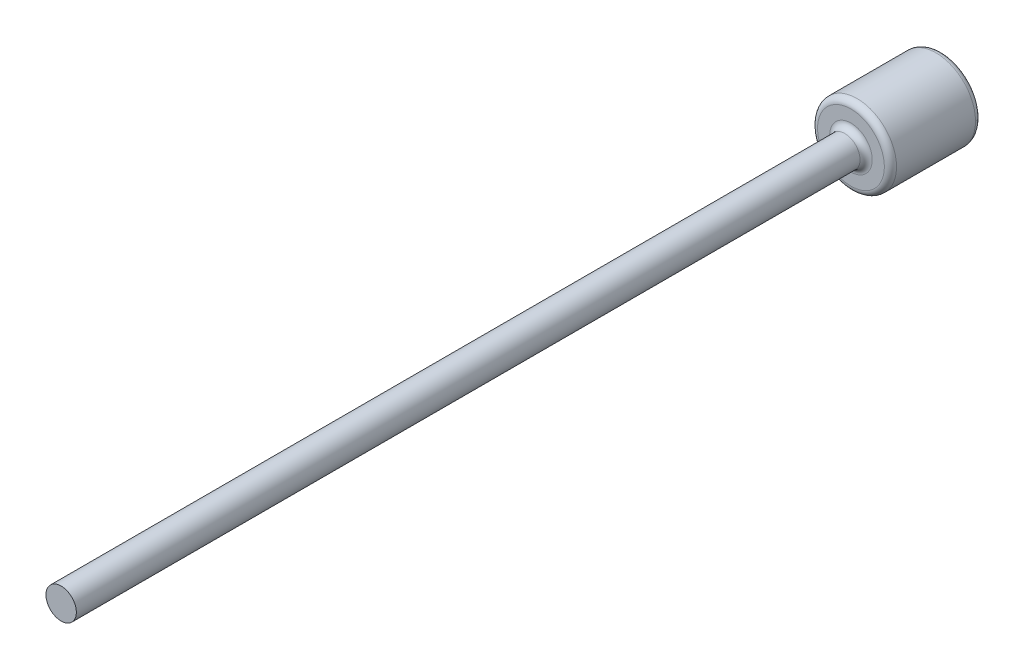
ISO-10303-21;
HEADER;
FILE_DESCRIPTION(('STEP AP214'),'2;1');
FILE_NAME('part.step','',(''),(''),'','','');
FILE_SCHEMA(('AUTOMOTIVE_DESIGN { 1 0 10303 214 1 1 1 1 }'));
ENDSEC;
DATA;
#1=APPLICATION_CONTEXT('core data for automotive mechanical design processes');
#2=APPLICATION_PROTOCOL_DEFINITION('international standard','automotive_design',2000,#1);
#3=PRODUCT_CONTEXT('',#1,'mechanical');
#4=PRODUCT('Part','Part','',(#3));
#5=PRODUCT_RELATED_PRODUCT_CATEGORY('part','',(#4));
#6=PRODUCT_DEFINITION_FORMATION('','',#4);
#7=PRODUCT_DEFINITION_CONTEXT('part definition',#1,'design');
#8=PRODUCT_DEFINITION('design','',#6,#7);
#9=PRODUCT_DEFINITION_SHAPE('','',#8);
#10=(LENGTH_UNIT() NAMED_UNIT(*) SI_UNIT(.MILLI.,.METRE.));
#11=(NAMED_UNIT(*) PLANE_ANGLE_UNIT() SI_UNIT($,.RADIAN.));
#12=(NAMED_UNIT(*) SI_UNIT($,.STERADIAN.) SOLID_ANGLE_UNIT());
#13=UNCERTAINTY_MEASURE_WITH_UNIT(LENGTH_MEASURE(1.E-05),#10,'distance_accuracy_value','');
#14=(GEOMETRIC_REPRESENTATION_CONTEXT(3) GLOBAL_UNCERTAINTY_ASSIGNED_CONTEXT((#13)) GLOBAL_UNIT_ASSIGNED_CONTEXT((#10,
#11,#12)) REPRESENTATION_CONTEXT('',''));
#15=CARTESIAN_POINT('',(0.,0.,0.));
#16=DIRECTION('',(0.,0.,1.));
#17=DIRECTION('',(1.,0.,0.));
#18=AXIS2_PLACEMENT_3D('',#15,#16,#17);
#19=CARTESIAN_POINT('',(0.,0.,-30.));
#20=DIRECTION('',(0.,0.,1.));
#21=DIRECTION('',(1.,0.,0.));
#22=AXIS2_PLACEMENT_3D('',#19,#20,#21);
#23=CYLINDRICAL_SURFACE('',#22,13.);
#24=CARTESIAN_POINT('',(0.,0.,-28.));
#25=DIRECTION('',(0.,0.,1.));
#26=DIRECTION('',(1.,0.,0.));
#27=AXIS2_PLACEMENT_3D('',#24,#25,#26);
#28=CIRCLE('',#27,13.);
#29=CARTESIAN_POINT('',(13.,0.,-28.));
#30=VERTEX_POINT('',#29);
#31=EDGE_CURVE('E52',#30,#30,#28,.T.);
#32=ORIENTED_EDGE('',*,*,#31,.T.);
#33=EDGE_LOOP('',(#32));
#34=FACE_BOUND('',#33,.T.);
#35=CARTESIAN_POINT('',(0.,0.,-2.));
#36=DIRECTION('',(0.,0.,1.));
#37=DIRECTION('',(1.,0.,0.));
#38=AXIS2_PLACEMENT_3D('',#35,#36,#37);
#39=CIRCLE('',#38,13.);
#40=CARTESIAN_POINT('',(13.,0.,-2.));
#41=VERTEX_POINT('',#40);
#42=EDGE_CURVE('E55',#41,#41,#39,.F.);
#43=ORIENTED_EDGE('',*,*,#42,.T.);
#44=EDGE_LOOP('',(#43));
#45=FACE_BOUND('',#44,.T.);
#46=ADVANCED_FACE('F32',(#34,#45),#23,.T.);
#47=CARTESIAN_POINT('',(0.,0.,-30.));
#48=DIRECTION('',(0.,0.,1.));
#49=DIRECTION('',(1.,0.,0.));
#50=AXIS2_PLACEMENT_3D('',#47,#48,#49);
#51=PLANE('',#50);
#52=CARTESIAN_POINT('',(0.,0.,-30.));
#53=DIRECTION('',(0.,0.,1.));
#54=DIRECTION('',(1.,0.,0.));
#55=AXIS2_PLACEMENT_3D('',#52,#53,#54);
#56=CIRCLE('',#55,11.);
#57=CARTESIAN_POINT('',(11.,0.,-30.));
#58=VERTEX_POINT('',#57);
#59=EDGE_CURVE('E47',#58,#58,#56,.F.);
#60=ORIENTED_EDGE('',*,*,#59,.T.);
#61=EDGE_LOOP('',(#60));
#62=FACE_BOUND('',#61,.T.);
#63=ADVANCED_FACE('F74',(#62),#51,.F.);
#64=CARTESIAN_POINT('',(0.,0.,0.));
#65=DIRECTION('',(0.,0.,1.));
#66=DIRECTION('',(1.,0.,0.));
#67=AXIS2_PLACEMENT_3D('',#64,#65,#66);
#68=PLANE('',#67);
#69=CARTESIAN_POINT('',(0.,0.,0.));
#70=DIRECTION('',(0.,0.,1.));
#71=DIRECTION('',(1.,0.,0.));
#72=AXIS2_PLACEMENT_3D('',#69,#70,#71);
#73=CIRCLE('',#72,11.);
#74=CARTESIAN_POINT('',(11.,0.,0.));
#75=VERTEX_POINT('',#74);
#76=EDGE_CURVE('E39',#75,#75,#73,.T.);
#77=ORIENTED_EDGE('',*,*,#76,.T.);
#78=EDGE_LOOP('',(#77));
#79=FACE_BOUND('',#78,.T.);
#80=CARTESIAN_POINT('',(0.,0.,0.));
#81=DIRECTION('',(0.,0.,1.));
#82=DIRECTION('',(1.,0.,0.));
#83=AXIS2_PLACEMENT_3D('',#80,#81,#82);
#84=CIRCLE('',#83,7.);
#85=CARTESIAN_POINT('',(7.,0.,0.));
#86=VERTEX_POINT('',#85);
#87=EDGE_CURVE('E43',#86,#86,#84,.F.);
#88=ORIENTED_EDGE('',*,*,#87,.T.);
#89=EDGE_LOOP('',(#88));
#90=FACE_BOUND('',#89,.T.);
#91=ADVANCED_FACE('F66',(#79,#90),#68,.T.);
#92=CARTESIAN_POINT('',(0.,0.,240.));
#93=DIRECTION('',(0.,0.,-1.));
#94=DIRECTION('',(-1.,0.,0.));
#95=AXIS2_PLACEMENT_3D('',#92,#93,#94);
#96=CYLINDRICAL_SURFACE('',#95,5.);
#97=CARTESIAN_POINT('',(0.,0.,2.));
#98=DIRECTION('',(0.,0.,1.));
#99=DIRECTION('',(1.,0.,0.));
#100=AXIS2_PLACEMENT_3D('',#97,#98,#99);
#101=CIRCLE('',#100,5.);
#102=CARTESIAN_POINT('',(5.,0.,2.));
#103=VERTEX_POINT('',#102);
#104=EDGE_CURVE('E10',#103,#103,#101,.T.);
#105=ORIENTED_EDGE('',*,*,#104,.T.);
#106=EDGE_LOOP('',(#105));
#107=FACE_BOUND('',#106,.T.);
#108=CARTESIAN_POINT('',(0.,0.,260.));
#109=DIRECTION('',(0.,0.,1.));
#110=DIRECTION('',(1.,0.,0.));
#111=AXIS2_PLACEMENT_3D('',#108,#109,#110);
#112=CIRCLE('',#111,5.);
#113=CARTESIAN_POINT('',(5.,0.,260.));
#114=VERTEX_POINT('',#113);
#115=EDGE_CURVE('E58',#114,#114,#112,.T.);
#116=ORIENTED_EDGE('',*,*,#115,.F.);
#117=EDGE_LOOP('',(#116));
#118=FACE_BOUND('',#117,.T.);
#119=ADVANCED_FACE('F64',(#107,#118),#96,.T.);
#120=CARTESIAN_POINT('',(0.,0.,260.));
#121=DIRECTION('',(0.,0.,1.));
#122=DIRECTION('',(1.,0.,0.));
#123=AXIS2_PLACEMENT_3D('',#120,#121,#122);
#124=PLANE('',#123);
#125=ORIENTED_EDGE('',*,*,#115,.T.);
#126=EDGE_LOOP('',(#125));
#127=FACE_BOUND('',#126,.T.);
#128=ADVANCED_FACE('F62',(#127),#124,.T.);
#129=CARTESIAN_POINT('',(0.,0.,-28.));
#130=DIRECTION('',(0.,0.,1.));
#131=DIRECTION('',(1.,0.,0.));
#132=AXIS2_PLACEMENT_3D('',#129,#130,#131);
#133=TOROIDAL_SURFACE('',#132,11.,2.);
#134=ORIENTED_EDGE('',*,*,#59,.F.);
#135=EDGE_LOOP('',(#134));
#136=FACE_BOUND('',#135,.T.);
#137=ORIENTED_EDGE('',*,*,#31,.F.);
#138=EDGE_LOOP('',(#137));
#139=FACE_BOUND('',#138,.T.);
#140=ADVANCED_FACE('F72',(#136,#139),#133,.T.);
#141=CARTESIAN_POINT('',(0.,0.,-2.));
#142=DIRECTION('',(0.,0.,1.));
#143=DIRECTION('',(1.,0.,0.));
#144=AXIS2_PLACEMENT_3D('',#141,#142,#143);
#145=TOROIDAL_SURFACE('',#144,11.,2.);
#146=ORIENTED_EDGE('',*,*,#42,.F.);
#147=EDGE_LOOP('',(#146));
#148=FACE_BOUND('',#147,.T.);
#149=ORIENTED_EDGE('',*,*,#76,.F.);
#150=EDGE_LOOP('',(#149));
#151=FACE_BOUND('',#150,.T.);
#152=ADVANCED_FACE('F87',(#148,#151),#145,.T.);
#153=CARTESIAN_POINT('',(0.,0.,2.));
#154=DIRECTION('',(0.,0.,1.));
#155=DIRECTION('',(1.,0.,0.));
#156=AXIS2_PLACEMENT_3D('',#153,#154,#155);
#157=TOROIDAL_SURFACE('',#156,7.,2.);
#158=ORIENTED_EDGE('',*,*,#87,.F.);
#159=EDGE_LOOP('',(#158));
#160=FACE_BOUND('',#159,.T.);
#161=ORIENTED_EDGE('',*,*,#104,.F.);
#162=EDGE_LOOP('',(#161));
#163=FACE_BOUND('',#162,.T.);
#164=ADVANCED_FACE('F34',(#160,#163),#157,.F.);
#165=CLOSED_SHELL('',(#46,#63,#91,#119,#128,#140,#152,#164));
#166=MANIFOLD_SOLID_BREP('B2',#165);
#167=ADVANCED_BREP_SHAPE_REPRESENTATION('',(#18,#166),#14);
#168=SHAPE_DEFINITION_REPRESENTATION(#9,#167);
ENDSEC;
END-ISO-10303-21;
